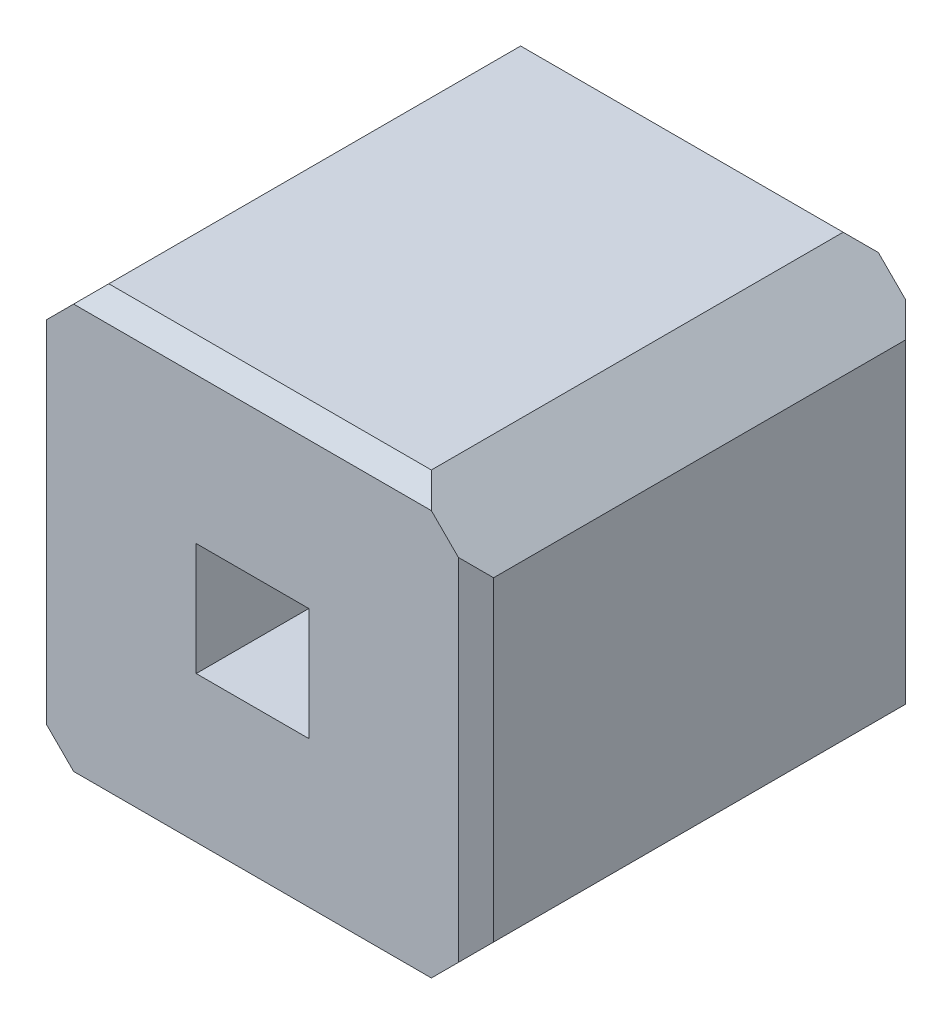
ISO-10303-21;
HEADER;
FILE_DESCRIPTION(('STEP AP214'),'2;1');
FILE_NAME('part.step','',(''),(''),'','','');
FILE_SCHEMA(('AUTOMOTIVE_DESIGN { 1 0 10303 214 1 1 1 1 }'));
ENDSEC;
DATA;
#1=APPLICATION_CONTEXT('core data for automotive mechanical design processes');
#2=APPLICATION_PROTOCOL_DEFINITION('international standard','automotive_design',2000,#1);
#3=PRODUCT_CONTEXT('',#1,'mechanical');
#4=PRODUCT('Part','Part','',(#3));
#5=PRODUCT_RELATED_PRODUCT_CATEGORY('part','',(#4));
#6=PRODUCT_DEFINITION_FORMATION('','',#4);
#7=PRODUCT_DEFINITION_CONTEXT('part definition',#1,'design');
#8=PRODUCT_DEFINITION('design','',#6,#7);
#9=PRODUCT_DEFINITION_SHAPE('','',#8);
#10=(LENGTH_UNIT() NAMED_UNIT(*) SI_UNIT(.MILLI.,.METRE.));
#11=(NAMED_UNIT(*) PLANE_ANGLE_UNIT() SI_UNIT($,.RADIAN.));
#12=(NAMED_UNIT(*) SI_UNIT($,.STERADIAN.) SOLID_ANGLE_UNIT());
#13=UNCERTAINTY_MEASURE_WITH_UNIT(LENGTH_MEASURE(1.E-05),#10,'distance_accuracy_value','');
#14=(GEOMETRIC_REPRESENTATION_CONTEXT(3) GLOBAL_UNCERTAINTY_ASSIGNED_CONTEXT((#13)) GLOBAL_UNIT_ASSIGNED_CONTEXT((#10,
#11,#12)) REPRESENTATION_CONTEXT('',''));
#15=CARTESIAN_POINT('',(0.,0.,0.));
#16=DIRECTION('',(0.,0.,1.));
#17=DIRECTION('',(1.,0.,0.));
#18=AXIS2_PLACEMENT_3D('',#15,#16,#17);
#19=CARTESIAN_POINT('',(0.,0.,2.54));
#20=DIRECTION('',(0.,0.,1.));
#21=DIRECTION('',(1.,0.,0.));
#22=AXIS2_PLACEMENT_3D('',#19,#20,#21);
#23=PLANE('',#22);
#24=DIRECTION('',(0.707106781186548,-0.707106781186547,0.));
#25=VECTOR('',#24,1.);
#26=CARTESIAN_POINT('',(-3.81,-0.8964466094,2.54));
#27=LINE('',#26,#25);
#28=CARTESIAN_POINT('',(-3.71,-0.9964466094,2.54));
#29=VERTEX_POINT('',#28);
#30=CARTESIAN_POINT('',(-3.5564466094,-1.15,2.54));
#31=VERTEX_POINT('',#30);
#32=EDGE_CURVE('E222',#29,#31,#27,.T.);
#33=ORIENTED_EDGE('',*,*,#32,.T.);
#34=DIRECTION('',(1.,0.,0.));
#35=VECTOR('',#34,1.);
#36=CARTESIAN_POINT('',(-1.6235533906,-1.15,2.54));
#37=LINE('',#36,#35);
#38=CARTESIAN_POINT('',(-1.5235533906,-1.15,2.54));
#39=VERTEX_POINT('',#38);
#40=EDGE_CURVE('E267',#31,#39,#37,.T.);
#41=ORIENTED_EDGE('',*,*,#40,.T.);
#42=DIRECTION('',(0.707106781186547,0.707106781186547,0.));
#43=VECTOR('',#42,1.);
#44=CARTESIAN_POINT('',(-1.6235533906,-1.25,2.54));
#45=LINE('',#44,#43);
#46=CARTESIAN_POINT('',(-1.37,-0.9964466094,2.54));
#47=VERTEX_POINT('',#46);
#48=EDGE_CURVE('E212',#39,#47,#45,.T.);
#49=ORIENTED_EDGE('',*,*,#48,.T.);
#50=DIRECTION('',(0.,1.,0.));
#51=VECTOR('',#50,1.);
#52=CARTESIAN_POINT('',(-1.37,0.8964466094,2.54));
#53=LINE('',#52,#51);
#54=CARTESIAN_POINT('',(-1.37,0.9964466094,2.54));
#55=VERTEX_POINT('',#54);
#56=EDGE_CURVE('E258',#47,#55,#53,.T.);
#57=ORIENTED_EDGE('',*,*,#56,.T.);
#58=DIRECTION('',(-0.707106781186547,0.707106781186547,0.));
#59=VECTOR('',#58,1.);
#60=CARTESIAN_POINT('',(-1.27,0.8964466094,2.54));
#61=LINE('',#60,#59);
#62=CARTESIAN_POINT('',(-1.5235533906,1.15,2.54));
#63=VERTEX_POINT('',#62);
#64=EDGE_CURVE('E215',#55,#63,#61,.T.);
#65=ORIENTED_EDGE('',*,*,#64,.T.);
#66=DIRECTION('',(-1.,0.,0.));
#67=VECTOR('',#66,1.);
#68=CARTESIAN_POINT('',(-3.4564466094,1.15,2.54));
#69=LINE('',#68,#67);
#70=CARTESIAN_POINT('',(-3.5564466094,1.15,2.54));
#71=VERTEX_POINT('',#70);
#72=EDGE_CURVE('E264',#63,#71,#69,.T.);
#73=ORIENTED_EDGE('',*,*,#72,.T.);
#74=DIRECTION('',(-0.707106781186548,-0.707106781186547,0.));
#75=VECTOR('',#74,1.);
#76=CARTESIAN_POINT('',(-3.4564466094,1.25,2.54));
#77=LINE('',#76,#75);
#78=CARTESIAN_POINT('',(-3.71,0.9964466094,2.54));
#79=VERTEX_POINT('',#78);
#80=EDGE_CURVE('E219',#71,#79,#77,.T.);
#81=ORIENTED_EDGE('',*,*,#80,.T.);
#82=DIRECTION('',(0.,-1.,0.));
#83=VECTOR('',#82,1.);
#84=CARTESIAN_POINT('',(-3.71,-0.8964466094,2.54));
#85=LINE('',#84,#83);
#86=EDGE_CURVE('E261',#79,#29,#85,.T.);
#87=ORIENTED_EDGE('',*,*,#86,.T.);
#88=EDGE_LOOP('',(#33,#41,#49,#57,#65,#73,#81,#87));
#89=FACE_BOUND('',#88,.T.);
#90=DIRECTION('',(0.,-1.,0.));
#91=VECTOR('',#90,1.);
#92=CARTESIAN_POINT('',(-2.86,-0.32,2.54));
#93=LINE('',#92,#91);
#94=CARTESIAN_POINT('',(-2.86,0.32,2.54));
#95=VERTEX_POINT('',#94);
#96=CARTESIAN_POINT('',(-2.86,-0.32,2.54));
#97=VERTEX_POINT('',#96);
#98=EDGE_CURVE('E181',#95,#97,#93,.T.);
#99=ORIENTED_EDGE('',*,*,#98,.F.);
#100=DIRECTION('',(-1.,0.,0.));
#101=VECTOR('',#100,1.);
#102=CARTESIAN_POINT('',(-2.86,0.32,2.54));
#103=LINE('',#102,#101);
#104=CARTESIAN_POINT('',(-2.22,0.32,2.54));
#105=VERTEX_POINT('',#104);
#106=EDGE_CURVE('E171',#105,#95,#103,.T.);
#107=ORIENTED_EDGE('',*,*,#106,.F.);
#108=DIRECTION('',(0.,1.,0.));
#109=VECTOR('',#108,1.);
#110=CARTESIAN_POINT('',(-2.22,0.32,2.54));
#111=LINE('',#110,#109);
#112=CARTESIAN_POINT('',(-2.22,-0.32,2.54));
#113=VERTEX_POINT('',#112);
#114=EDGE_CURVE('E196',#113,#105,#111,.T.);
#115=ORIENTED_EDGE('',*,*,#114,.F.);
#116=DIRECTION('',(1.,0.,0.));
#117=VECTOR('',#116,1.);
#118=CARTESIAN_POINT('',(-2.22,-0.32,2.54));
#119=LINE('',#118,#117);
#120=EDGE_CURVE('E194',#97,#113,#119,.T.);
#121=ORIENTED_EDGE('',*,*,#120,.F.);
#122=EDGE_LOOP('',(#99,#107,#115,#121));
#123=FACE_BOUND('',#122,.T.);
#124=ADVANCED_FACE('F32',(#89,#123),#23,.T.);
#125=CARTESIAN_POINT('',(0.,0.,0.));
#126=DIRECTION('',(0.,0.,1.));
#127=DIRECTION('',(1.,0.,0.));
#128=AXIS2_PLACEMENT_3D('',#125,#126,#127);
#129=PLANE('',#128);
#130=DIRECTION('',(-0.707106781186548,-0.707106781186547,0.));
#131=VECTOR('',#130,1.);
#132=CARTESIAN_POINT('',(-3.4564466094,1.25,0.));
#133=LINE('',#132,#131);
#134=CARTESIAN_POINT('',(-3.5564466094,1.15,0.));
#135=VERTEX_POINT('',#134);
#136=CARTESIAN_POINT('',(-3.71,0.9964466094,0.));
#137=VERTEX_POINT('',#136);
#138=EDGE_CURVE('E231',#135,#137,#133,.T.);
#139=ORIENTED_EDGE('',*,*,#138,.F.);
#140=DIRECTION('',(1.,0.,0.));
#141=VECTOR('',#140,1.);
#142=CARTESIAN_POINT('',(0.,1.15,0.));
#143=LINE('',#142,#141);
#144=CARTESIAN_POINT('',(-1.5235533906,1.15,0.));
#145=VERTEX_POINT('',#144);
#146=EDGE_CURVE('E310',#135,#145,#143,.T.);
#147=ORIENTED_EDGE('',*,*,#146,.T.);
#148=DIRECTION('',(-0.707106781186547,0.707106781186547,0.));
#149=VECTOR('',#148,1.);
#150=CARTESIAN_POINT('',(-1.27,0.8964466094,0.));
#151=LINE('',#150,#149);
#152=CARTESIAN_POINT('',(-1.37,0.9964466094,0.));
#153=VERTEX_POINT('',#152);
#154=EDGE_CURVE('E228',#153,#145,#151,.T.);
#155=ORIENTED_EDGE('',*,*,#154,.F.);
#156=DIRECTION('',(0.,-1.,0.));
#157=VECTOR('',#156,1.);
#158=CARTESIAN_POINT('',(-1.37,0.,0.));
#159=LINE('',#158,#157);
#160=CARTESIAN_POINT('',(-1.37,-0.996446609400001,0.));
#161=VERTEX_POINT('',#160);
#162=EDGE_CURVE('E304',#153,#161,#159,.T.);
#163=ORIENTED_EDGE('',*,*,#162,.T.);
#164=DIRECTION('',(0.707106781186547,0.707106781186547,0.));
#165=VECTOR('',#164,1.);
#166=CARTESIAN_POINT('',(-1.6235533906,-1.25,0.));
#167=LINE('',#166,#165);
#168=CARTESIAN_POINT('',(-1.5235533906,-1.15,0.));
#169=VERTEX_POINT('',#168);
#170=EDGE_CURVE('E189',#169,#161,#167,.T.);
#171=ORIENTED_EDGE('',*,*,#170,.F.);
#172=DIRECTION('',(-1.,0.,0.));
#173=VECTOR('',#172,1.);
#174=CARTESIAN_POINT('',(0.,-1.15,0.));
#175=LINE('',#174,#173);
#176=CARTESIAN_POINT('',(-3.5564466094,-1.15,0.));
#177=VERTEX_POINT('',#176);
#178=EDGE_CURVE('E308',#169,#177,#175,.T.);
#179=ORIENTED_EDGE('',*,*,#178,.T.);
#180=DIRECTION('',(0.707106781186548,-0.707106781186547,0.));
#181=VECTOR('',#180,1.);
#182=CARTESIAN_POINT('',(-3.81,-0.8964466094,0.));
#183=LINE('',#182,#181);
#184=CARTESIAN_POINT('',(-3.71,-0.9964466094,0.));
#185=VERTEX_POINT('',#184);
#186=EDGE_CURVE('E216',#185,#177,#183,.T.);
#187=ORIENTED_EDGE('',*,*,#186,.F.);
#188=DIRECTION('',(0.,1.,0.));
#189=VECTOR('',#188,1.);
#190=CARTESIAN_POINT('',(-3.71,0.,0.));
#191=LINE('',#190,#189);
#192=EDGE_CURVE('E306',#185,#137,#191,.T.);
#193=ORIENTED_EDGE('',*,*,#192,.T.);
#194=EDGE_LOOP('',(#139,#147,#155,#163,#171,#179,#187,#193));
#195=FACE_BOUND('',#194,.T.);
#196=DIRECTION('',(-1.,0.,0.));
#197=VECTOR('',#196,1.);
#198=CARTESIAN_POINT('',(-2.86,0.32,0.));
#199=LINE('',#198,#197);
#200=CARTESIAN_POINT('',(-2.22,0.32,0.));
#201=VERTEX_POINT('',#200);
#202=CARTESIAN_POINT('',(-2.86,0.32,0.));
#203=VERTEX_POINT('',#202);
#204=EDGE_CURVE('E200',#201,#203,#199,.T.);
#205=ORIENTED_EDGE('',*,*,#204,.T.);
#206=DIRECTION('',(0.,-1.,0.));
#207=VECTOR('',#206,1.);
#208=CARTESIAN_POINT('',(-2.86,-0.32,0.));
#209=LINE('',#208,#207);
#210=CARTESIAN_POINT('',(-2.86,-0.32,0.));
#211=VERTEX_POINT('',#210);
#212=EDGE_CURVE('E188',#203,#211,#209,.T.);
#213=ORIENTED_EDGE('',*,*,#212,.T.);
#214=DIRECTION('',(1.,0.,0.));
#215=VECTOR('',#214,1.);
#216=CARTESIAN_POINT('',(-2.22,-0.32,0.));
#217=LINE('',#216,#215);
#218=CARTESIAN_POINT('',(-2.22,-0.32,0.));
#219=VERTEX_POINT('',#218);
#220=EDGE_CURVE('E203',#211,#219,#217,.T.);
#221=ORIENTED_EDGE('',*,*,#220,.T.);
#222=DIRECTION('',(0.,1.,0.));
#223=VECTOR('',#222,1.);
#224=CARTESIAN_POINT('',(-2.22,0.32,0.));
#225=LINE('',#224,#223);
#226=EDGE_CURVE('E182',#219,#201,#225,.T.);
#227=ORIENTED_EDGE('',*,*,#226,.T.);
#228=EDGE_LOOP('',(#205,#213,#221,#227));
#229=FACE_BOUND('',#228,.T.);
#230=ADVANCED_FACE('F332',(#195,#229),#129,.F.);
#231=CARTESIAN_POINT('',(-1.6235533906,-1.25,2.54));
#232=DIRECTION('',(-0.707106781186548,0.707106781186548,0.));
#233=DIRECTION('',(-0.707106781186548,-0.707106781186548,0.));
#234=AXIS2_PLACEMENT_3D('',#231,#232,#233);
#235=PLANE('',#234);
#236=ORIENTED_EDGE('',*,*,#48,.F.);
#237=DIRECTION('',(-0.577350269189625,-0.577350269189625,-0.577350269189628));
#238=VECTOR('',#237,1.);
#239=CARTESIAN_POINT('',(-1.0157022604,-0.642148869800002,3.0478511302));
#240=LINE('',#239,#238);
#241=CARTESIAN_POINT('',(-1.6235533906,-1.25,2.44));
#242=VERTEX_POINT('',#241);
#243=EDGE_CURVE('E276',#39,#242,#240,.T.);
#244=ORIENTED_EDGE('',*,*,#243,.T.);
#245=DIRECTION('',(0.,0.,-1.));
#246=VECTOR('',#245,1.);
#247=CARTESIAN_POINT('',(-1.6235533906,-1.25,2.54));
#248=LINE('',#247,#246);
#249=CARTESIAN_POINT('',(-1.6235533906,-1.25,0.1));
#250=VERTEX_POINT('',#249);
#251=EDGE_CURVE('E225',#242,#250,#248,.T.);
#252=ORIENTED_EDGE('',*,*,#251,.T.);
#253=DIRECTION('',(-0.577350269189626,-0.577350269189626,0.577350269189626));
#254=VECTOR('',#253,1.);
#255=CARTESIAN_POINT('',(-2.23451779686667,-1.86096440626667,0.710964406266667));
#256=LINE('',#255,#254);
#257=EDGE_CURVE('E274',#250,#169,#256,.F.);
#258=ORIENTED_EDGE('',*,*,#257,.T.);
#259=ORIENTED_EDGE('',*,*,#170,.T.);
#260=DIRECTION('',(-0.577350269189626,-0.577350269189626,-0.577350269189626));
#261=VECTOR('',#260,1.);
#262=CARTESIAN_POINT('',(-1.27,-0.8964466094,0.1));
#263=LINE('',#262,#261);
#264=CARTESIAN_POINT('',(-1.27,-0.8964466094,0.100000000000001));
#265=VERTEX_POINT('',#264);
#266=EDGE_CURVE('E270',#161,#265,#263,.F.);
#267=ORIENTED_EDGE('',*,*,#266,.T.);
#268=DIRECTION('',(0.,0.,-1.));
#269=VECTOR('',#268,1.);
#270=CARTESIAN_POINT('',(-1.27,-0.8964466094,2.54));
#271=LINE('',#270,#269);
#272=CARTESIAN_POINT('',(-1.27,-0.8964466094,2.44));
#273=VERTEX_POINT('',#272);
#274=EDGE_CURVE('E255',#273,#265,#271,.T.);
#275=ORIENTED_EDGE('',*,*,#274,.F.);
#276=DIRECTION('',(-0.577350269189625,-0.577350269189625,0.577350269189628));
#277=VECTOR('',#276,1.);
#278=CARTESIAN_POINT('',(-1.0378511302,-0.664297739600001,2.2078511302));
#279=LINE('',#278,#277);
#280=EDGE_CURVE('E272',#273,#47,#279,.T.);
#281=ORIENTED_EDGE('',*,*,#280,.T.);
#282=EDGE_LOOP('',(#236,#244,#252,#258,#259,#267,#275,#281));
#283=FACE_BOUND('',#282,.T.);
#284=ADVANCED_FACE('F338',(#283),#235,.F.);
#285=CARTESIAN_POINT('',(-1.27,-0.8964466094,2.54));
#286=DIRECTION('',(-1.,0.,0.));
#287=DIRECTION('',(0.,0.,1.));
#288=AXIS2_PLACEMENT_3D('',#285,#286,#287);
#289=PLANE('',#288);
#290=DIRECTION('',(0.,0.,-1.));
#291=VECTOR('',#290,1.);
#292=CARTESIAN_POINT('',(-1.27,0.8964466094,2.54));
#293=LINE('',#292,#291);
#294=CARTESIAN_POINT('',(-1.27,0.8964466094,2.44));
#295=VERTEX_POINT('',#294);
#296=CARTESIAN_POINT('',(-1.27,0.8964466094,0.1));
#297=VERTEX_POINT('',#296);
#298=EDGE_CURVE('E253',#295,#297,#293,.T.);
#299=ORIENTED_EDGE('',*,*,#298,.F.);
#300=DIRECTION('',(0.,-1.,0.));
#301=VECTOR('',#300,1.);
#302=CARTESIAN_POINT('',(-1.27,-0.8964466094,2.44));
#303=LINE('',#302,#301);
#304=EDGE_CURVE('E11',#295,#273,#303,.T.);
#305=ORIENTED_EDGE('',*,*,#304,.T.);
#306=ORIENTED_EDGE('',*,*,#274,.T.);
#307=DIRECTION('',(0.,1.,0.));
#308=VECTOR('',#307,1.);
#309=CARTESIAN_POINT('',(-1.27,-0.8964466094,0.1));
#310=LINE('',#309,#308);
#311=EDGE_CURVE('E40',#265,#297,#310,.T.);
#312=ORIENTED_EDGE('',*,*,#311,.T.);
#313=EDGE_LOOP('',(#299,#305,#306,#312));
#314=FACE_BOUND('',#313,.T.);
#315=ADVANCED_FACE('F323',(#314),#289,.F.);
#316=CARTESIAN_POINT('',(-1.27,0.8964466094,2.54));
#317=DIRECTION('',(-0.707106781186548,-0.707106781186548,0.));
#318=DIRECTION('',(0.707106781186548,-0.707106781186548,0.));
#319=AXIS2_PLACEMENT_3D('',#316,#317,#318);
#320=PLANE('',#319);
#321=ORIENTED_EDGE('',*,*,#154,.T.);
#322=DIRECTION('',(0.577350269189626,-0.577350269189626,-0.577350269189626));
#323=VECTOR('',#322,1.);
#324=CARTESIAN_POINT('',(-1.6235533906,1.25,0.1));
#325=LINE('',#324,#323);
#326=CARTESIAN_POINT('',(-1.6235533906,1.25,0.100000000000001));
#327=VERTEX_POINT('',#326);
#328=EDGE_CURVE('E316',#145,#327,#325,.F.);
#329=ORIENTED_EDGE('',*,*,#328,.T.);
#330=DIRECTION('',(0.,0.,-1.));
#331=VECTOR('',#330,1.);
#332=CARTESIAN_POINT('',(-1.6235533906,1.25,2.54));
#333=LINE('',#332,#331);
#334=CARTESIAN_POINT('',(-1.6235533906,1.25,2.44));
#335=VERTEX_POINT('',#334);
#336=EDGE_CURVE('E250',#335,#327,#333,.T.);
#337=ORIENTED_EDGE('',*,*,#336,.F.);
#338=DIRECTION('',(0.577350269189625,-0.577350269189625,0.577350269189628));
#339=VECTOR('',#338,1.);
#340=CARTESIAN_POINT('',(-1.0157022604,0.642148869800002,3.0478511302));
#341=LINE('',#340,#339);
#342=EDGE_CURVE('E314',#335,#63,#341,.T.);
#343=ORIENTED_EDGE('',*,*,#342,.T.);
#344=ORIENTED_EDGE('',*,*,#64,.F.);
#345=DIRECTION('',(0.577350269189625,-0.577350269189625,-0.577350269189628));
#346=VECTOR('',#345,1.);
#347=CARTESIAN_POINT('',(-1.0378511302,0.664297739600001,2.2078511302));
#348=LINE('',#347,#346);
#349=EDGE_CURVE('E55',#55,#295,#348,.T.);
#350=ORIENTED_EDGE('',*,*,#349,.T.);
#351=ORIENTED_EDGE('',*,*,#298,.T.);
#352=DIRECTION('',(0.577350269189626,-0.577350269189626,0.577350269189626));
#353=VECTOR('',#352,1.);
#354=CARTESIAN_POINT('',(-0.672368927066667,0.298815536466667,0.697631072933334));
#355=LINE('',#354,#353);
#356=EDGE_CURVE('E47',#297,#153,#355,.F.);
#357=ORIENTED_EDGE('',*,*,#356,.T.);
#358=EDGE_LOOP('',(#321,#329,#337,#343,#344,#350,#351,#357));
#359=FACE_BOUND('',#358,.T.);
#360=ADVANCED_FACE('F327',(#359),#320,.F.);
#361=CARTESIAN_POINT('',(-1.6235533906,1.25,2.54));
#362=DIRECTION('',(0.,-1.,0.));
#363=DIRECTION('',(0.,0.,-1.));
#364=AXIS2_PLACEMENT_3D('',#361,#362,#363);
#365=PLANE('',#364);
#366=ORIENTED_EDGE('',*,*,#336,.T.);
#367=DIRECTION('',(-1.,0.,0.));
#368=VECTOR('',#367,1.);
#369=CARTESIAN_POINT('',(-1.6235533906,1.25,0.1));
#370=LINE('',#369,#368);
#371=CARTESIAN_POINT('',(-3.4564466094,1.25,0.1));
#372=VERTEX_POINT('',#371);
#373=EDGE_CURVE('E293',#327,#372,#370,.T.);
#374=ORIENTED_EDGE('',*,*,#373,.T.);
#375=DIRECTION('',(0.,0.,-1.));
#376=VECTOR('',#375,1.);
#377=CARTESIAN_POINT('',(-3.4564466094,1.25,2.54));
#378=LINE('',#377,#376);
#379=CARTESIAN_POINT('',(-3.4564466094,1.25,2.44));
#380=VERTEX_POINT('',#379);
#381=EDGE_CURVE('E247',#380,#372,#378,.T.);
#382=ORIENTED_EDGE('',*,*,#381,.F.);
#383=DIRECTION('',(1.,0.,0.));
#384=VECTOR('',#383,1.);
#385=CARTESIAN_POINT('',(-1.6235533906,1.25,2.44));
#386=LINE('',#385,#384);
#387=EDGE_CURVE('E291',#380,#335,#386,.T.);
#388=ORIENTED_EDGE('',*,*,#387,.T.);
#389=EDGE_LOOP('',(#366,#374,#382,#388));
#390=FACE_BOUND('',#389,.T.);
#391=ADVANCED_FACE('F381',(#390),#365,.F.);
#392=CARTESIAN_POINT('',(-3.4564466094,1.25,2.54));
#393=DIRECTION('',(0.707106781186547,-0.707106781186548,0.));
#394=DIRECTION('',(0.707106781186548,0.707106781186547,0.));
#395=AXIS2_PLACEMENT_3D('',#392,#393,#394);
#396=PLANE('',#395);
#397=ORIENTED_EDGE('',*,*,#381,.T.);
#398=DIRECTION('',(0.577350269189626,0.577350269189626,0.577350269189626));
#399=VECTOR('',#398,1.);
#400=CARTESIAN_POINT('',(-2.84548220313333,1.86096440626667,0.710964406266667));
#401=LINE('',#400,#399);
#402=EDGE_CURVE('E302',#372,#135,#401,.F.);
#403=ORIENTED_EDGE('',*,*,#402,.T.);
#404=ORIENTED_EDGE('',*,*,#138,.T.);
#405=DIRECTION('',(0.577350269189626,0.577350269189626,-0.577350269189626));
#406=VECTOR('',#405,1.);
#407=CARTESIAN_POINT('',(-4.40763107293333,0.298815536466667,0.697631072933333));
#408=LINE('',#407,#406);
#409=CARTESIAN_POINT('',(-3.81,0.8964466094,0.1));
#410=VERTEX_POINT('',#409);
#411=EDGE_CURVE('E298',#137,#410,#408,.F.);
#412=ORIENTED_EDGE('',*,*,#411,.T.);
#413=DIRECTION('',(0.,0.,-1.));
#414=VECTOR('',#413,1.);
#415=CARTESIAN_POINT('',(-3.81,0.8964466094,2.54));
#416=LINE('',#415,#414);
#417=CARTESIAN_POINT('',(-3.81,0.8964466094,2.44));
#418=VERTEX_POINT('',#417);
#419=EDGE_CURVE('E244',#418,#410,#416,.T.);
#420=ORIENTED_EDGE('',*,*,#419,.F.);
#421=DIRECTION('',(0.577350269189625,0.577350269189625,0.577350269189628));
#422=VECTOR('',#421,1.);
#423=CARTESIAN_POINT('',(-4.0421488698,0.664297739600001,2.2078511302));
#424=LINE('',#423,#422);
#425=EDGE_CURVE('E296',#418,#79,#424,.T.);
#426=ORIENTED_EDGE('',*,*,#425,.T.);
#427=ORIENTED_EDGE('',*,*,#80,.F.);
#428=DIRECTION('',(0.577350269189625,0.577350269189625,-0.577350269189627));
#429=VECTOR('',#428,1.);
#430=CARTESIAN_POINT('',(-2.37096440626667,2.33548220313333,1.35451779686667));
#431=LINE('',#430,#429);
#432=EDGE_CURVE('E300',#71,#380,#431,.T.);
#433=ORIENTED_EDGE('',*,*,#432,.T.);
#434=EDGE_LOOP('',(#397,#403,#404,#412,#420,#426,#427,#433));
#435=FACE_BOUND('',#434,.T.);
#436=ADVANCED_FACE('F375',(#435),#396,.F.);
#437=CARTESIAN_POINT('',(-3.81,-0.8964466094,2.54));
#438=DIRECTION('',(1.,0.,0.));
#439=DIRECTION('',(0.,0.,-1.));
#440=AXIS2_PLACEMENT_3D('',#437,#438,#439);
#441=PLANE('',#440);
#442=ORIENTED_EDGE('',*,*,#419,.T.);
#443=DIRECTION('',(0.,-1.,0.));
#444=VECTOR('',#443,1.);
#445=CARTESIAN_POINT('',(-3.81,-0.8964466094,0.1));
#446=LINE('',#445,#444);
#447=CARTESIAN_POINT('',(-3.81,-0.8964466094,0.100000000000001));
#448=VERTEX_POINT('',#447);
#449=EDGE_CURVE('E320',#410,#448,#446,.T.);
#450=ORIENTED_EDGE('',*,*,#449,.T.);
#451=DIRECTION('',(0.,0.,-1.));
#452=VECTOR('',#451,1.);
#453=CARTESIAN_POINT('',(-3.81,-0.8964466094,2.54));
#454=LINE('',#453,#452);
#455=CARTESIAN_POINT('',(-3.81,-0.8964466094,2.44));
#456=VERTEX_POINT('',#455);
#457=EDGE_CURVE('E241',#456,#448,#454,.T.);
#458=ORIENTED_EDGE('',*,*,#457,.F.);
#459=DIRECTION('',(0.,1.,0.));
#460=VECTOR('',#459,1.);
#461=CARTESIAN_POINT('',(-3.81,0.8964466094,2.44));
#462=LINE('',#461,#460);
#463=EDGE_CURVE('E318',#456,#418,#462,.T.);
#464=ORIENTED_EDGE('',*,*,#463,.T.);
#465=EDGE_LOOP('',(#442,#450,#458,#464));
#466=FACE_BOUND('',#465,.T.);
#467=ADVANCED_FACE('F367',(#466),#441,.F.);
#468=CARTESIAN_POINT('',(-3.81,-0.8964466094,2.54));
#469=DIRECTION('',(0.707106781186547,0.707106781186548,0.));
#470=DIRECTION('',(-0.707106781186548,0.707106781186547,0.));
#471=AXIS2_PLACEMENT_3D('',#468,#469,#470);
#472=PLANE('',#471);
#473=DIRECTION('',(0.,0.,-1.));
#474=VECTOR('',#473,1.);
#475=CARTESIAN_POINT('',(-3.4564466094,-1.25,2.54));
#476=LINE('',#475,#474);
#477=CARTESIAN_POINT('',(-3.4564466094,-1.25,2.44));
#478=VERTEX_POINT('',#477);
#479=CARTESIAN_POINT('',(-3.4564466094,-1.25,0.1));
#480=VERTEX_POINT('',#479);
#481=EDGE_CURVE('E238',#478,#480,#476,.T.);
#482=ORIENTED_EDGE('',*,*,#481,.F.);
#483=DIRECTION('',(-0.577350269189625,0.577350269189625,0.577350269189627));
#484=VECTOR('',#483,1.);
#485=CARTESIAN_POINT('',(-2.37096440626667,-2.33548220313333,1.35451779686667));
#486=LINE('',#485,#484);
#487=EDGE_CURVE('E289',#478,#31,#486,.T.);
#488=ORIENTED_EDGE('',*,*,#487,.T.);
#489=ORIENTED_EDGE('',*,*,#32,.F.);
#490=DIRECTION('',(-0.577350269189625,0.577350269189625,-0.577350269189628));
#491=VECTOR('',#490,1.);
#492=CARTESIAN_POINT('',(-4.0421488698,-0.664297739600001,2.2078511302));
#493=LINE('',#492,#491);
#494=EDGE_CURVE('E283',#29,#456,#493,.T.);
#495=ORIENTED_EDGE('',*,*,#494,.T.);
#496=ORIENTED_EDGE('',*,*,#457,.T.);
#497=DIRECTION('',(-0.577350269189626,0.577350269189626,0.577350269189626));
#498=VECTOR('',#497,1.);
#499=CARTESIAN_POINT('',(-3.81,-0.8964466094,0.1));
#500=LINE('',#499,#498);
#501=EDGE_CURVE('E285',#448,#185,#500,.F.);
#502=ORIENTED_EDGE('',*,*,#501,.T.);
#503=ORIENTED_EDGE('',*,*,#186,.T.);
#504=DIRECTION('',(-0.577350269189626,0.577350269189626,-0.577350269189626));
#505=VECTOR('',#504,1.);
#506=CARTESIAN_POINT('',(-3.4564466094,-1.25,0.1));
#507=LINE('',#506,#505);
#508=EDGE_CURVE('E287',#177,#480,#507,.F.);
#509=ORIENTED_EDGE('',*,*,#508,.T.);
#510=EDGE_LOOP('',(#482,#488,#489,#495,#496,#502,#503,#509));
#511=FACE_BOUND('',#510,.T.);
#512=ADVANCED_FACE('F348',(#511),#472,.F.);
#513=CARTESIAN_POINT('',(-3.4564466094,-1.25,2.54));
#514=DIRECTION('',(0.,1.,0.));
#515=DIRECTION('',(0.,0.,1.));
#516=AXIS2_PLACEMENT_3D('',#513,#514,#515);
#517=PLANE('',#516);
#518=ORIENTED_EDGE('',*,*,#251,.F.);
#519=DIRECTION('',(-1.,0.,0.));
#520=VECTOR('',#519,1.);
#521=CARTESIAN_POINT('',(-3.4564466094,-1.25,2.44));
#522=LINE('',#521,#520);
#523=EDGE_CURVE('E281',#242,#478,#522,.T.);
#524=ORIENTED_EDGE('',*,*,#523,.T.);
#525=ORIENTED_EDGE('',*,*,#481,.T.);
#526=DIRECTION('',(1.,0.,0.));
#527=VECTOR('',#526,1.);
#528=CARTESIAN_POINT('',(-3.4564466094,-1.25,0.1));
#529=LINE('',#528,#527);
#530=EDGE_CURVE('E278',#480,#250,#529,.T.);
#531=ORIENTED_EDGE('',*,*,#530,.T.);
#532=EDGE_LOOP('',(#518,#524,#525,#531));
#533=FACE_BOUND('',#532,.T.);
#534=ADVANCED_FACE('F352',(#533),#517,.F.);
#535=CARTESIAN_POINT('',(-2.86,0.32,2.54));
#536=DIRECTION('',(0.,-1.,0.));
#537=DIRECTION('',(0.,0.,-1.));
#538=AXIS2_PLACEMENT_3D('',#535,#536,#537);
#539=PLANE('',#538);
#540=ORIENTED_EDGE('',*,*,#204,.F.);
#541=DIRECTION('',(0.,0.,-1.));
#542=VECTOR('',#541,1.);
#543=CARTESIAN_POINT('',(-2.22,0.32,2.54));
#544=LINE('',#543,#542);
#545=EDGE_CURVE('E177',#105,#201,#544,.T.);
#546=ORIENTED_EDGE('',*,*,#545,.F.);
#547=ORIENTED_EDGE('',*,*,#106,.T.);
#548=DIRECTION('',(0.,0.,-1.));
#549=VECTOR('',#548,1.);
#550=CARTESIAN_POINT('',(-2.86,0.32,2.54));
#551=LINE('',#550,#549);
#552=EDGE_CURVE('E174',#95,#203,#551,.T.);
#553=ORIENTED_EDGE('',*,*,#552,.T.);
#554=EDGE_LOOP('',(#540,#546,#547,#553));
#555=FACE_BOUND('',#554,.T.);
#556=ADVANCED_FACE('F173',(#555),#539,.T.);
#557=CARTESIAN_POINT('',(-2.86,-0.32,2.54));
#558=DIRECTION('',(1.,0.,0.));
#559=DIRECTION('',(0.,0.,-1.));
#560=AXIS2_PLACEMENT_3D('',#557,#558,#559);
#561=PLANE('',#560);
#562=ORIENTED_EDGE('',*,*,#212,.F.);
#563=ORIENTED_EDGE('',*,*,#552,.F.);
#564=ORIENTED_EDGE('',*,*,#98,.T.);
#565=DIRECTION('',(0.,0.,-1.));
#566=VECTOR('',#565,1.);
#567=CARTESIAN_POINT('',(-2.86,-0.32,2.54));
#568=LINE('',#567,#566);
#569=EDGE_CURVE('E190',#97,#211,#568,.T.);
#570=ORIENTED_EDGE('',*,*,#569,.T.);
#571=EDGE_LOOP('',(#562,#563,#564,#570));
#572=FACE_BOUND('',#571,.T.);
#573=ADVANCED_FACE('F185',(#572),#561,.T.);
#574=CARTESIAN_POINT('',(-2.22,-0.32,2.54));
#575=DIRECTION('',(0.,1.,0.));
#576=DIRECTION('',(0.,0.,1.));
#577=AXIS2_PLACEMENT_3D('',#574,#575,#576);
#578=PLANE('',#577);
#579=ORIENTED_EDGE('',*,*,#220,.F.);
#580=ORIENTED_EDGE('',*,*,#569,.F.);
#581=ORIENTED_EDGE('',*,*,#120,.T.);
#582=DIRECTION('',(0.,0.,-1.));
#583=VECTOR('',#582,1.);
#584=CARTESIAN_POINT('',(-2.22,-0.32,2.54));
#585=LINE('',#584,#583);
#586=EDGE_CURVE('E209',#113,#219,#585,.T.);
#587=ORIENTED_EDGE('',*,*,#586,.T.);
#588=EDGE_LOOP('',(#579,#580,#581,#587));
#589=FACE_BOUND('',#588,.T.);
#590=ADVANCED_FACE('F482',(#589),#578,.T.);
#591=CARTESIAN_POINT('',(-2.22,0.32,2.54));
#592=DIRECTION('',(-1.,0.,0.));
#593=DIRECTION('',(0.,0.,1.));
#594=AXIS2_PLACEMENT_3D('',#591,#592,#593);
#595=PLANE('',#594);
#596=ORIENTED_EDGE('',*,*,#226,.F.);
#597=ORIENTED_EDGE('',*,*,#586,.F.);
#598=ORIENTED_EDGE('',*,*,#114,.T.);
#599=ORIENTED_EDGE('',*,*,#545,.T.);
#600=EDGE_LOOP('',(#596,#597,#598,#599));
#601=FACE_BOUND('',#600,.T.);
#602=ADVANCED_FACE('F424',(#601),#595,.T.);
#603=CARTESIAN_POINT('',(0.,-1.15,2.54));
#604=DIRECTION('',(0.,-0.707106781186549,0.707106781186546));
#605=DIRECTION('',(-1.,0.,0.));
#606=AXIS2_PLACEMENT_3D('',#603,#604,#605);
#607=PLANE('',#606);
#608=ORIENTED_EDGE('',*,*,#487,.F.);
#609=ORIENTED_EDGE('',*,*,#523,.F.);
#610=ORIENTED_EDGE('',*,*,#243,.F.);
#611=ORIENTED_EDGE('',*,*,#40,.F.);
#612=EDGE_LOOP('',(#608,#609,#610,#611));
#613=FACE_BOUND('',#612,.T.);
#614=ADVANCED_FACE('F355',(#613),#607,.T.);
#615=CARTESIAN_POINT('',(-1.6235533906,1.25,0.1));
#616=DIRECTION('',(0.,-0.707106781186547,0.707106781186547));
#617=DIRECTION('',(-1.,0.,0.));
#618=AXIS2_PLACEMENT_3D('',#615,#616,#617);
#619=PLANE('',#618);
#620=ORIENTED_EDGE('',*,*,#328,.F.);
#621=ORIENTED_EDGE('',*,*,#146,.F.);
#622=ORIENTED_EDGE('',*,*,#402,.F.);
#623=ORIENTED_EDGE('',*,*,#373,.F.);
#624=EDGE_LOOP('',(#620,#621,#622,#623));
#625=FACE_BOUND('',#624,.T.);
#626=ADVANCED_FACE('F379',(#625),#619,.F.);
#627=CARTESIAN_POINT('',(-3.4564466094,-1.25,0.1));
#628=DIRECTION('',(0.,0.707106781186547,0.707106781186547));
#629=DIRECTION('',(1.,0.,0.));
#630=AXIS2_PLACEMENT_3D('',#627,#628,#629);
#631=PLANE('',#630);
#632=ORIENTED_EDGE('',*,*,#508,.F.);
#633=ORIENTED_EDGE('',*,*,#178,.F.);
#634=ORIENTED_EDGE('',*,*,#257,.F.);
#635=ORIENTED_EDGE('',*,*,#530,.F.);
#636=EDGE_LOOP('',(#632,#633,#634,#635));
#637=FACE_BOUND('',#636,.T.);
#638=ADVANCED_FACE('F344',(#637),#631,.F.);
#639=CARTESIAN_POINT('',(0.,1.15,2.54));
#640=DIRECTION('',(0.,0.707106781186549,0.707106781186546));
#641=DIRECTION('',(1.,0.,0.));
#642=AXIS2_PLACEMENT_3D('',#639,#640,#641);
#643=PLANE('',#642);
#644=ORIENTED_EDGE('',*,*,#342,.F.);
#645=ORIENTED_EDGE('',*,*,#387,.F.);
#646=ORIENTED_EDGE('',*,*,#432,.F.);
#647=ORIENTED_EDGE('',*,*,#72,.F.);
#648=EDGE_LOOP('',(#644,#645,#646,#647));
#649=FACE_BOUND('',#648,.T.);
#650=ADVANCED_FACE('F387',(#649),#643,.T.);
#651=CARTESIAN_POINT('',(-3.81,-0.8964466094,0.1));
#652=DIRECTION('',(0.707106781186547,0.,0.707106781186547));
#653=DIRECTION('',(0.,-1.,0.));
#654=AXIS2_PLACEMENT_3D('',#651,#652,#653);
#655=PLANE('',#654);
#656=ORIENTED_EDGE('',*,*,#411,.F.);
#657=ORIENTED_EDGE('',*,*,#192,.F.);
#658=ORIENTED_EDGE('',*,*,#501,.F.);
#659=ORIENTED_EDGE('',*,*,#449,.F.);
#660=EDGE_LOOP('',(#656,#657,#658,#659));
#661=FACE_BOUND('',#660,.T.);
#662=ADVANCED_FACE('F372',(#661),#655,.F.);
#663=CARTESIAN_POINT('',(-3.71,0.,2.54));
#664=DIRECTION('',(-0.707106781186549,0.,0.707106781186546));
#665=DIRECTION('',(0.,1.,0.));
#666=AXIS2_PLACEMENT_3D('',#663,#664,#665);
#667=PLANE('',#666);
#668=ORIENTED_EDGE('',*,*,#425,.F.);
#669=ORIENTED_EDGE('',*,*,#463,.F.);
#670=ORIENTED_EDGE('',*,*,#494,.F.);
#671=ORIENTED_EDGE('',*,*,#86,.F.);
#672=EDGE_LOOP('',(#668,#669,#670,#671));
#673=FACE_BOUND('',#672,.T.);
#674=ADVANCED_FACE('F363',(#673),#667,.T.);
#675=CARTESIAN_POINT('',(-1.37,0.,2.54));
#676=DIRECTION('',(0.707106781186549,0.,0.707106781186546));
#677=DIRECTION('',(0.,-1.,0.));
#678=AXIS2_PLACEMENT_3D('',#675,#676,#677);
#679=PLANE('',#678);
#680=ORIENTED_EDGE('',*,*,#280,.F.);
#681=ORIENTED_EDGE('',*,*,#304,.F.);
#682=ORIENTED_EDGE('',*,*,#349,.F.);
#683=ORIENTED_EDGE('',*,*,#56,.F.);
#684=EDGE_LOOP('',(#680,#681,#682,#683));
#685=FACE_BOUND('',#684,.T.);
#686=ADVANCED_FACE('F390',(#685),#679,.T.);
#687=CARTESIAN_POINT('',(-1.27,-0.8964466094,0.1));
#688=DIRECTION('',(-0.707106781186547,0.,0.707106781186547));
#689=DIRECTION('',(0.,1.,0.));
#690=AXIS2_PLACEMENT_3D('',#687,#688,#689);
#691=PLANE('',#690);
#692=ORIENTED_EDGE('',*,*,#266,.F.);
#693=ORIENTED_EDGE('',*,*,#162,.F.);
#694=ORIENTED_EDGE('',*,*,#356,.F.);
#695=ORIENTED_EDGE('',*,*,#311,.F.);
#696=EDGE_LOOP('',(#692,#693,#694,#695));
#697=FACE_BOUND('',#696,.T.);
#698=ADVANCED_FACE('F34',(#697),#691,.F.);
#699=CLOSED_SHELL('',(#124,#230,#284,#315,#360,#391,#436,#467,#512,#534,#556,#573,#590,#602,
#614,#626,#638,#650,#662,#674,#686,#698));
#700=MANIFOLD_SOLID_BREP('B2',#699);
#701=ADVANCED_BREP_SHAPE_REPRESENTATION('',(#18,#700),#14);
#702=SHAPE_DEFINITION_REPRESENTATION(#9,#701);
ENDSEC;
END-ISO-10303-21;
